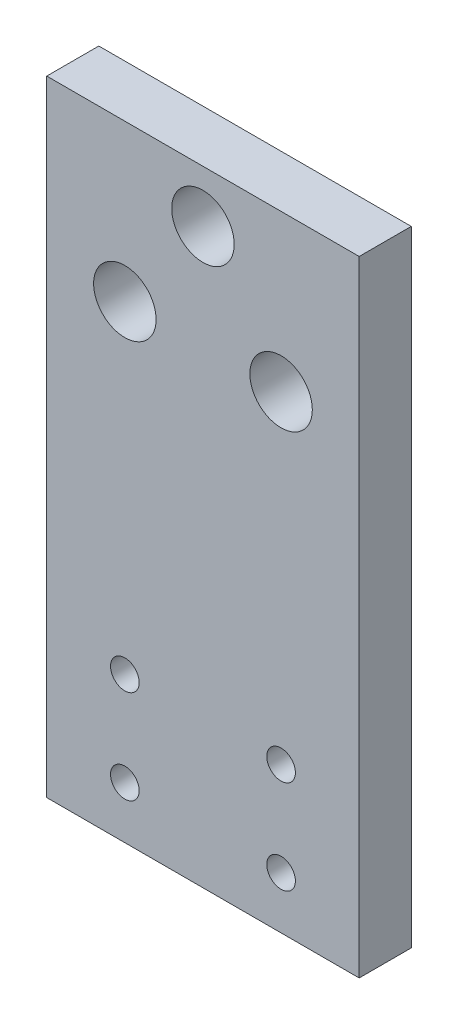
ISO-10303-21;
HEADER;
FILE_DESCRIPTION(('STEP AP214'),'2;1');
FILE_NAME('part.step','',(''),(''),'','','');
FILE_SCHEMA(('AUTOMOTIVE_DESIGN { 1 0 10303 214 1 1 1 1 }'));
ENDSEC;
DATA;
#1=APPLICATION_CONTEXT('core data for automotive mechanical design processes');
#2=APPLICATION_PROTOCOL_DEFINITION('international standard','automotive_design',2000,#1);
#3=PRODUCT_CONTEXT('',#1,'mechanical');
#4=PRODUCT('Part','Part','',(#3));
#5=PRODUCT_RELATED_PRODUCT_CATEGORY('part','',(#4));
#6=PRODUCT_DEFINITION_FORMATION('','',#4);
#7=PRODUCT_DEFINITION_CONTEXT('part definition',#1,'design');
#8=PRODUCT_DEFINITION('design','',#6,#7);
#9=PRODUCT_DEFINITION_SHAPE('','',#8);
#10=(LENGTH_UNIT() NAMED_UNIT(*) SI_UNIT(.MILLI.,.METRE.));
#11=(NAMED_UNIT(*) PLANE_ANGLE_UNIT() SI_UNIT($,.RADIAN.));
#12=(NAMED_UNIT(*) SI_UNIT($,.STERADIAN.) SOLID_ANGLE_UNIT());
#13=UNCERTAINTY_MEASURE_WITH_UNIT(LENGTH_MEASURE(1.E-05),#10,'distance_accuracy_value','');
#14=(GEOMETRIC_REPRESENTATION_CONTEXT(3) GLOBAL_UNCERTAINTY_ASSIGNED_CONTEXT((#13)) GLOBAL_UNIT_ASSIGNED_CONTEXT((#10,
#11,#12)) REPRESENTATION_CONTEXT('',''));
#15=CARTESIAN_POINT('',(0.,0.,0.));
#16=DIRECTION('',(0.,0.,1.));
#17=DIRECTION('',(1.,0.,0.));
#18=AXIS2_PLACEMENT_3D('',#15,#16,#17);
#19=CARTESIAN_POINT('',(30.,60.,10.));
#20=DIRECTION('',(-1.,0.,0.));
#21=DIRECTION('',(0.,-1.,0.));
#22=AXIS2_PLACEMENT_3D('',#19,#20,#21);
#23=PLANE('',#22);
#24=DIRECTION('',(0.,1.,0.));
#25=VECTOR('',#24,1.);
#26=CARTESIAN_POINT('',(30.,60.,0.));
#27=LINE('',#26,#25);
#28=CARTESIAN_POINT('',(30.,-60.,0.));
#29=VERTEX_POINT('',#28);
#30=CARTESIAN_POINT('',(30.,60.,0.));
#31=VERTEX_POINT('',#30);
#32=EDGE_CURVE('E103',#29,#31,#27,.T.);
#33=ORIENTED_EDGE('',*,*,#32,.T.);
#34=DIRECTION('',(0.,0.,-1.));
#35=VECTOR('',#34,1.);
#36=CARTESIAN_POINT('',(30.,60.,10.));
#37=LINE('',#36,#35);
#38=CARTESIAN_POINT('',(30.,60.,10.));
#39=VERTEX_POINT('',#38);
#40=EDGE_CURVE('E11',#39,#31,#37,.T.);
#41=ORIENTED_EDGE('',*,*,#40,.F.);
#42=DIRECTION('',(0.,1.,0.));
#43=VECTOR('',#42,1.);
#44=CARTESIAN_POINT('',(30.,60.,10.));
#45=LINE('',#44,#43);
#46=CARTESIAN_POINT('',(30.,-60.,10.));
#47=VERTEX_POINT('',#46);
#48=EDGE_CURVE('E90',#47,#39,#45,.T.);
#49=ORIENTED_EDGE('',*,*,#48,.F.);
#50=DIRECTION('',(0.,0.,-1.));
#51=VECTOR('',#50,1.);
#52=CARTESIAN_POINT('',(30.,-60.,10.));
#53=LINE('',#52,#51);
#54=EDGE_CURVE('E99',#47,#29,#53,.T.);
#55=ORIENTED_EDGE('',*,*,#54,.T.);
#56=EDGE_LOOP('',(#33,#41,#49,#55));
#57=FACE_BOUND('',#56,.T.);
#58=ADVANCED_FACE('F37',(#57),#23,.F.);
#59=CARTESIAN_POINT('',(-30.,60.,10.));
#60=DIRECTION('',(0.,-1.,0.));
#61=DIRECTION('',(0.,0.,-1.));
#62=AXIS2_PLACEMENT_3D('',#59,#60,#61);
#63=PLANE('',#62);
#64=DIRECTION('',(-1.,0.,0.));
#65=VECTOR('',#64,1.);
#66=CARTESIAN_POINT('',(-30.,60.,0.));
#67=LINE('',#66,#65);
#68=CARTESIAN_POINT('',(-30.,60.,0.));
#69=VERTEX_POINT('',#68);
#70=EDGE_CURVE('E94',#31,#69,#67,.T.);
#71=ORIENTED_EDGE('',*,*,#70,.T.);
#72=DIRECTION('',(0.,0.,-1.));
#73=VECTOR('',#72,1.);
#74=CARTESIAN_POINT('',(-30.,60.,10.));
#75=LINE('',#74,#73);
#76=CARTESIAN_POINT('',(-30.,60.,10.));
#77=VERTEX_POINT('',#76);
#78=EDGE_CURVE('E46',#77,#69,#75,.T.);
#79=ORIENTED_EDGE('',*,*,#78,.F.);
#80=DIRECTION('',(-1.,0.,0.));
#81=VECTOR('',#80,1.);
#82=CARTESIAN_POINT('',(-30.,60.,10.));
#83=LINE('',#82,#81);
#84=EDGE_CURVE('E85',#39,#77,#83,.T.);
#85=ORIENTED_EDGE('',*,*,#84,.F.);
#86=ORIENTED_EDGE('',*,*,#40,.T.);
#87=EDGE_LOOP('',(#71,#79,#85,#86));
#88=FACE_BOUND('',#87,.T.);
#89=ADVANCED_FACE('F93',(#88),#63,.F.);
#90=CARTESIAN_POINT('',(-30.,60.,10.));
#91=DIRECTION('',(1.,0.,0.));
#92=DIRECTION('',(0.,1.,0.));
#93=AXIS2_PLACEMENT_3D('',#90,#91,#92);
#94=PLANE('',#93);
#95=DIRECTION('',(0.,-1.,0.));
#96=VECTOR('',#95,1.);
#97=CARTESIAN_POINT('',(-30.,60.,0.));
#98=LINE('',#97,#96);
#99=CARTESIAN_POINT('',(-30.,-60.,0.));
#100=VERTEX_POINT('',#99);
#101=EDGE_CURVE('E72',#69,#100,#98,.T.);
#102=ORIENTED_EDGE('',*,*,#101,.T.);
#103=DIRECTION('',(0.,0.,-1.));
#104=VECTOR('',#103,1.);
#105=CARTESIAN_POINT('',(-30.,-60.,10.));
#106=LINE('',#105,#104);
#107=CARTESIAN_POINT('',(-30.,-60.,10.));
#108=VERTEX_POINT('',#107);
#109=EDGE_CURVE('E95',#108,#100,#106,.T.);
#110=ORIENTED_EDGE('',*,*,#109,.F.);
#111=DIRECTION('',(0.,-1.,0.));
#112=VECTOR('',#111,1.);
#113=CARTESIAN_POINT('',(-30.,60.,10.));
#114=LINE('',#113,#112);
#115=EDGE_CURVE('E88',#77,#108,#114,.T.);
#116=ORIENTED_EDGE('',*,*,#115,.F.);
#117=ORIENTED_EDGE('',*,*,#78,.T.);
#118=EDGE_LOOP('',(#102,#110,#116,#117));
#119=FACE_BOUND('',#118,.T.);
#120=ADVANCED_FACE('F97',(#119),#94,.F.);
#121=CARTESIAN_POINT('',(-30.,-60.,10.));
#122=DIRECTION('',(0.,1.,0.));
#123=DIRECTION('',(0.,0.,1.));
#124=AXIS2_PLACEMENT_3D('',#121,#122,#123);
#125=PLANE('',#124);
#126=DIRECTION('',(1.,0.,0.));
#127=VECTOR('',#126,1.);
#128=CARTESIAN_POINT('',(-30.,-60.,0.));
#129=LINE('',#128,#127);
#130=EDGE_CURVE('E78',#100,#29,#129,.T.);
#131=ORIENTED_EDGE('',*,*,#130,.T.);
#132=ORIENTED_EDGE('',*,*,#54,.F.);
#133=DIRECTION('',(1.,0.,0.));
#134=VECTOR('',#133,1.);
#135=CARTESIAN_POINT('',(-30.,-60.,10.));
#136=LINE('',#135,#134);
#137=EDGE_CURVE('E55',#108,#47,#136,.T.);
#138=ORIENTED_EDGE('',*,*,#137,.F.);
#139=ORIENTED_EDGE('',*,*,#109,.T.);
#140=EDGE_LOOP('',(#131,#132,#138,#139));
#141=FACE_BOUND('',#140,.T.);
#142=ADVANCED_FACE('F178',(#141),#125,.F.);
#143=CARTESIAN_POINT('',(0.,0.,10.));
#144=DIRECTION('',(0.,0.,1.));
#145=DIRECTION('',(1.,0.,0.));
#146=AXIS2_PLACEMENT_3D('',#143,#144,#145);
#147=PLANE('',#146);
#148=CARTESIAN_POINT('',(-15.,30.,10.));
#149=DIRECTION('',(0.,0.,1.));
#150=DIRECTION('',(1.,0.,0.));
#151=AXIS2_PLACEMENT_3D('',#148,#149,#150);
#152=CIRCLE('',#151,6.);
#153=CARTESIAN_POINT('',(-9.00000000000001,30.,10.));
#154=VERTEX_POINT('',#153);
#155=EDGE_CURVE('E132',#154,#154,#152,.T.);
#156=ORIENTED_EDGE('',*,*,#155,.F.);
#157=EDGE_LOOP('',(#156));
#158=FACE_BOUND('',#157,.T.);
#159=CARTESIAN_POINT('',(15.,30.,10.));
#160=DIRECTION('',(0.,0.,1.));
#161=DIRECTION('',(1.,0.,0.));
#162=AXIS2_PLACEMENT_3D('',#159,#160,#161);
#163=CIRCLE('',#162,6.);
#164=CARTESIAN_POINT('',(21.,30.,10.));
#165=VERTEX_POINT('',#164);
#166=EDGE_CURVE('E122',#165,#165,#163,.T.);
#167=ORIENTED_EDGE('',*,*,#166,.F.);
#168=EDGE_LOOP('',(#167));
#169=FACE_BOUND('',#168,.T.);
#170=CARTESIAN_POINT('',(0.,50.,10.));
#171=DIRECTION('',(0.,0.,1.));
#172=DIRECTION('',(1.,0.,0.));
#173=AXIS2_PLACEMENT_3D('',#170,#171,#172);
#174=CIRCLE('',#173,6.);
#175=CARTESIAN_POINT('',(6.,50.,10.));
#176=VERTEX_POINT('',#175);
#177=EDGE_CURVE('E119',#176,#176,#174,.T.);
#178=ORIENTED_EDGE('',*,*,#177,.F.);
#179=EDGE_LOOP('',(#178));
#180=FACE_BOUND('',#179,.T.);
#181=CARTESIAN_POINT('',(-15.,-32.,10.));
#182=DIRECTION('',(0.,0.,1.));
#183=DIRECTION('',(1.,0.,0.));
#184=AXIS2_PLACEMENT_3D('',#181,#182,#183);
#185=CIRCLE('',#184,2.75);
#186=CARTESIAN_POINT('',(-12.25,-32.,10.));
#187=VERTEX_POINT('',#186);
#188=EDGE_CURVE('E116',#187,#187,#185,.T.);
#189=ORIENTED_EDGE('',*,*,#188,.F.);
#190=EDGE_LOOP('',(#189));
#191=FACE_BOUND('',#190,.T.);
#192=CARTESIAN_POINT('',(15.,-32.,10.));
#193=DIRECTION('',(0.,0.,1.));
#194=DIRECTION('',(1.,0.,0.));
#195=AXIS2_PLACEMENT_3D('',#192,#193,#194);
#196=CIRCLE('',#195,2.75);
#197=CARTESIAN_POINT('',(17.75,-32.,10.));
#198=VERTEX_POINT('',#197);
#199=EDGE_CURVE('E115',#198,#198,#196,.T.);
#200=ORIENTED_EDGE('',*,*,#199,.F.);
#201=EDGE_LOOP('',(#200));
#202=FACE_BOUND('',#201,.T.);
#203=CARTESIAN_POINT('',(15.,-50.,10.));
#204=DIRECTION('',(0.,0.,1.));
#205=DIRECTION('',(1.,0.,0.));
#206=AXIS2_PLACEMENT_3D('',#203,#204,#205);
#207=CIRCLE('',#206,2.75);
#208=CARTESIAN_POINT('',(17.75,-50.,10.));
#209=VERTEX_POINT('',#208);
#210=EDGE_CURVE('E142',#209,#209,#207,.T.);
#211=ORIENTED_EDGE('',*,*,#210,.F.);
#212=EDGE_LOOP('',(#211));
#213=FACE_BOUND('',#212,.T.);
#214=CARTESIAN_POINT('',(-15.,-50.,10.));
#215=DIRECTION('',(0.,0.,1.));
#216=DIRECTION('',(1.,0.,0.));
#217=AXIS2_PLACEMENT_3D('',#214,#215,#216);
#218=CIRCLE('',#217,2.75);
#219=CARTESIAN_POINT('',(-12.25,-50.,10.));
#220=VERTEX_POINT('',#219);
#221=EDGE_CURVE('E148',#220,#220,#218,.T.);
#222=ORIENTED_EDGE('',*,*,#221,.F.);
#223=EDGE_LOOP('',(#222));
#224=FACE_BOUND('',#223,.T.);
#225=ORIENTED_EDGE('',*,*,#48,.T.);
#226=ORIENTED_EDGE('',*,*,#84,.T.);
#227=ORIENTED_EDGE('',*,*,#115,.T.);
#228=ORIENTED_EDGE('',*,*,#137,.T.);
#229=EDGE_LOOP('',(#225,#226,#227,#228));
#230=FACE_BOUND('',#229,.T.);
#231=ADVANCED_FACE('F86',(#158,#169,#180,#191,#202,#213,#224,#230),#147,.T.);
#232=CARTESIAN_POINT('',(0.,0.,0.));
#233=DIRECTION('',(0.,0.,1.));
#234=DIRECTION('',(1.,0.,0.));
#235=AXIS2_PLACEMENT_3D('',#232,#233,#234);
#236=PLANE('',#235);
#237=CARTESIAN_POINT('',(-15.,30.,0.));
#238=DIRECTION('',(0.,0.,1.));
#239=DIRECTION('',(1.,0.,0.));
#240=AXIS2_PLACEMENT_3D('',#237,#238,#239);
#241=CIRCLE('',#240,6.);
#242=CARTESIAN_POINT('',(-9.00000000000001,30.,0.));
#243=VERTEX_POINT('',#242);
#244=EDGE_CURVE('E40',#243,#243,#241,.T.);
#245=ORIENTED_EDGE('',*,*,#244,.T.);
#246=EDGE_LOOP('',(#245));
#247=FACE_BOUND('',#246,.T.);
#248=CARTESIAN_POINT('',(15.,30.,0.));
#249=DIRECTION('',(0.,0.,1.));
#250=DIRECTION('',(1.,0.,0.));
#251=AXIS2_PLACEMENT_3D('',#248,#249,#250);
#252=CIRCLE('',#251,6.);
#253=CARTESIAN_POINT('',(21.,30.,0.));
#254=VERTEX_POINT('',#253);
#255=EDGE_CURVE('E120',#254,#254,#252,.T.);
#256=ORIENTED_EDGE('',*,*,#255,.T.);
#257=EDGE_LOOP('',(#256));
#258=FACE_BOUND('',#257,.T.);
#259=CARTESIAN_POINT('',(0.,50.,0.));
#260=DIRECTION('',(0.,0.,1.));
#261=DIRECTION('',(1.,0.,0.));
#262=AXIS2_PLACEMENT_3D('',#259,#260,#261);
#263=CIRCLE('',#262,6.);
#264=CARTESIAN_POINT('',(6.,50.,0.));
#265=VERTEX_POINT('',#264);
#266=EDGE_CURVE('E117',#265,#265,#263,.T.);
#267=ORIENTED_EDGE('',*,*,#266,.T.);
#268=EDGE_LOOP('',(#267));
#269=FACE_BOUND('',#268,.T.);
#270=CARTESIAN_POINT('',(-15.,-32.,0.));
#271=DIRECTION('',(0.,0.,1.));
#272=DIRECTION('',(1.,0.,0.));
#273=AXIS2_PLACEMENT_3D('',#270,#271,#272);
#274=CIRCLE('',#273,2.75);
#275=CARTESIAN_POINT('',(-12.25,-32.,0.));
#276=VERTEX_POINT('',#275);
#277=EDGE_CURVE('E112',#276,#276,#274,.T.);
#278=ORIENTED_EDGE('',*,*,#277,.T.);
#279=EDGE_LOOP('',(#278));
#280=FACE_BOUND('',#279,.T.);
#281=CARTESIAN_POINT('',(15.,-32.,0.));
#282=DIRECTION('',(0.,0.,1.));
#283=DIRECTION('',(1.,0.,0.));
#284=AXIS2_PLACEMENT_3D('',#281,#282,#283);
#285=CIRCLE('',#284,2.75);
#286=CARTESIAN_POINT('',(17.75,-32.,0.));
#287=VERTEX_POINT('',#286);
#288=EDGE_CURVE('E139',#287,#287,#285,.T.);
#289=ORIENTED_EDGE('',*,*,#288,.T.);
#290=EDGE_LOOP('',(#289));
#291=FACE_BOUND('',#290,.T.);
#292=CARTESIAN_POINT('',(15.,-50.,0.));
#293=DIRECTION('',(0.,0.,1.));
#294=DIRECTION('',(1.,0.,0.));
#295=AXIS2_PLACEMENT_3D('',#292,#293,#294);
#296=CIRCLE('',#295,2.75);
#297=CARTESIAN_POINT('',(17.75,-50.,0.));
#298=VERTEX_POINT('',#297);
#299=EDGE_CURVE('E145',#298,#298,#296,.T.);
#300=ORIENTED_EDGE('',*,*,#299,.T.);
#301=EDGE_LOOP('',(#300));
#302=FACE_BOUND('',#301,.T.);
#303=CARTESIAN_POINT('',(-15.,-50.,0.));
#304=DIRECTION('',(0.,0.,1.));
#305=DIRECTION('',(1.,0.,0.));
#306=AXIS2_PLACEMENT_3D('',#303,#304,#305);
#307=CIRCLE('',#306,2.75);
#308=CARTESIAN_POINT('',(-12.25,-50.,0.));
#309=VERTEX_POINT('',#308);
#310=EDGE_CURVE('E106',#309,#309,#307,.T.);
#311=ORIENTED_EDGE('',*,*,#310,.T.);
#312=EDGE_LOOP('',(#311));
#313=FACE_BOUND('',#312,.T.);
#314=ORIENTED_EDGE('',*,*,#32,.F.);
#315=ORIENTED_EDGE('',*,*,#130,.F.);
#316=ORIENTED_EDGE('',*,*,#101,.F.);
#317=ORIENTED_EDGE('',*,*,#70,.F.);
#318=EDGE_LOOP('',(#314,#315,#316,#317));
#319=FACE_BOUND('',#318,.T.);
#320=ADVANCED_FACE('F154',(#247,#258,#269,#280,#291,#302,#313,#319),#236,.F.);
#321=CARTESIAN_POINT('',(-15.,-50.,10.));
#322=DIRECTION('',(0.,0.,1.));
#323=DIRECTION('',(1.,0.,0.));
#324=AXIS2_PLACEMENT_3D('',#321,#322,#323);
#325=CYLINDRICAL_SURFACE('',#324,2.75);
#326=ORIENTED_EDGE('',*,*,#221,.T.);
#327=EDGE_LOOP('',(#326));
#328=FACE_BOUND('',#327,.T.);
#329=ORIENTED_EDGE('',*,*,#310,.F.);
#330=EDGE_LOOP('',(#329));
#331=FACE_BOUND('',#330,.T.);
#332=ADVANCED_FACE('F157',(#328,#331),#325,.F.);
#333=CARTESIAN_POINT('',(15.,-50.,10.));
#334=DIRECTION('',(0.,0.,1.));
#335=DIRECTION('',(1.,0.,0.));
#336=AXIS2_PLACEMENT_3D('',#333,#334,#335);
#337=CYLINDRICAL_SURFACE('',#336,2.75);
#338=ORIENTED_EDGE('',*,*,#210,.T.);
#339=EDGE_LOOP('',(#338));
#340=FACE_BOUND('',#339,.T.);
#341=ORIENTED_EDGE('',*,*,#299,.F.);
#342=EDGE_LOOP('',(#341));
#343=FACE_BOUND('',#342,.T.);
#344=ADVANCED_FACE('F159',(#340,#343),#337,.F.);
#345=CARTESIAN_POINT('',(15.,-32.,10.));
#346=DIRECTION('',(0.,0.,1.));
#347=DIRECTION('',(1.,0.,0.));
#348=AXIS2_PLACEMENT_3D('',#345,#346,#347);
#349=CYLINDRICAL_SURFACE('',#348,2.75);
#350=ORIENTED_EDGE('',*,*,#199,.T.);
#351=EDGE_LOOP('',(#350));
#352=FACE_BOUND('',#351,.T.);
#353=ORIENTED_EDGE('',*,*,#288,.F.);
#354=EDGE_LOOP('',(#353));
#355=FACE_BOUND('',#354,.T.);
#356=ADVANCED_FACE('F166',(#352,#355),#349,.F.);
#357=CARTESIAN_POINT('',(-15.,-32.,10.));
#358=DIRECTION('',(0.,0.,1.));
#359=DIRECTION('',(1.,0.,0.));
#360=AXIS2_PLACEMENT_3D('',#357,#358,#359);
#361=CYLINDRICAL_SURFACE('',#360,2.75);
#362=ORIENTED_EDGE('',*,*,#188,.T.);
#363=EDGE_LOOP('',(#362));
#364=FACE_BOUND('',#363,.T.);
#365=ORIENTED_EDGE('',*,*,#277,.F.);
#366=EDGE_LOOP('',(#365));
#367=FACE_BOUND('',#366,.T.);
#368=ADVANCED_FACE('F236',(#364,#367),#361,.F.);
#369=CARTESIAN_POINT('',(0.,50.,10.));
#370=DIRECTION('',(0.,0.,1.));
#371=DIRECTION('',(1.,0.,0.));
#372=AXIS2_PLACEMENT_3D('',#369,#370,#371);
#373=CYLINDRICAL_SURFACE('',#372,6.);
#374=ORIENTED_EDGE('',*,*,#177,.T.);
#375=EDGE_LOOP('',(#374));
#376=FACE_BOUND('',#375,.T.);
#377=ORIENTED_EDGE('',*,*,#266,.F.);
#378=EDGE_LOOP('',(#377));
#379=FACE_BOUND('',#378,.T.);
#380=ADVANCED_FACE('F245',(#376,#379),#373,.F.);
#381=CARTESIAN_POINT('',(15.,30.,10.));
#382=DIRECTION('',(0.,0.,1.));
#383=DIRECTION('',(1.,0.,0.));
#384=AXIS2_PLACEMENT_3D('',#381,#382,#383);
#385=CYLINDRICAL_SURFACE('',#384,6.);
#386=ORIENTED_EDGE('',*,*,#166,.T.);
#387=EDGE_LOOP('',(#386));
#388=FACE_BOUND('',#387,.T.);
#389=ORIENTED_EDGE('',*,*,#255,.F.);
#390=EDGE_LOOP('',(#389));
#391=FACE_BOUND('',#390,.T.);
#392=ADVANCED_FACE('F254',(#388,#391),#385,.F.);
#393=CARTESIAN_POINT('',(-15.,30.,10.));
#394=DIRECTION('',(0.,0.,1.));
#395=DIRECTION('',(1.,0.,0.));
#396=AXIS2_PLACEMENT_3D('',#393,#394,#395);
#397=CYLINDRICAL_SURFACE('',#396,6.);
#398=ORIENTED_EDGE('',*,*,#155,.T.);
#399=EDGE_LOOP('',(#398));
#400=FACE_BOUND('',#399,.T.);
#401=ORIENTED_EDGE('',*,*,#244,.F.);
#402=EDGE_LOOP('',(#401));
#403=FACE_BOUND('',#402,.T.);
#404=ADVANCED_FACE('F263',(#400,#403),#397,.F.);
#405=CLOSED_SHELL('',(#58,#89,#120,#142,#231,#320,#332,#344,#356,#368,#380,#392,#404));
#406=MANIFOLD_SOLID_BREP('B2',#405);
#407=ADVANCED_BREP_SHAPE_REPRESENTATION('',(#18,#406),#14);
#408=SHAPE_DEFINITION_REPRESENTATION(#9,#407);
ENDSEC;
END-ISO-10303-21;
